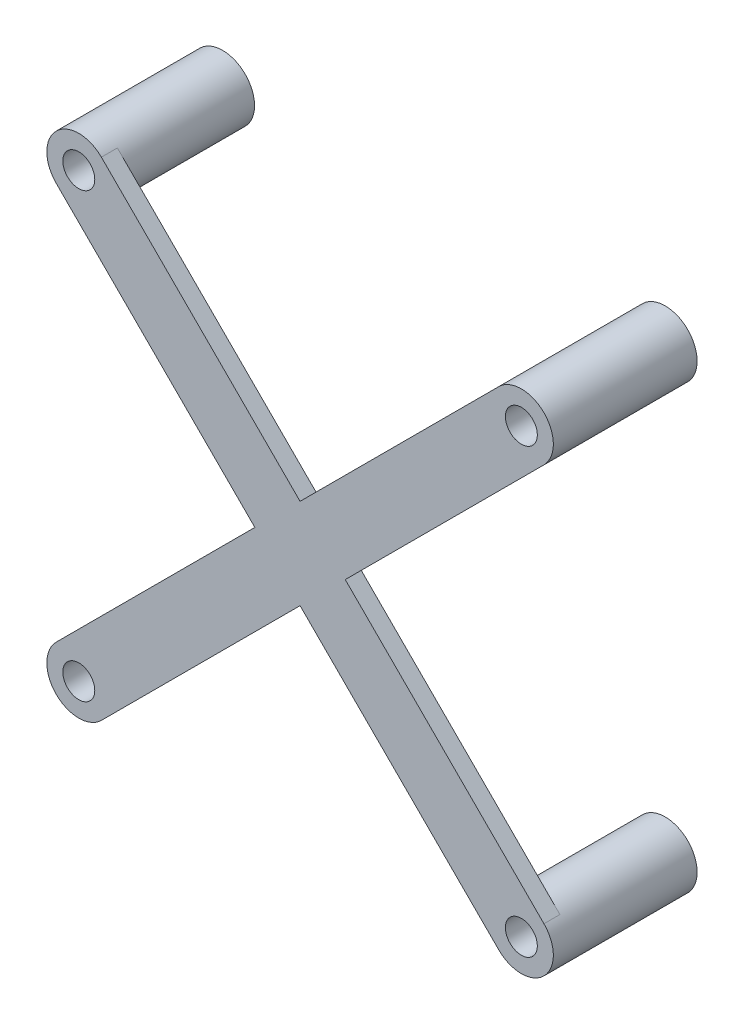
ISO-10303-21;
HEADER;
FILE_DESCRIPTION(('STEP AP214'),'2;1');
FILE_NAME('part.step','',(''),(''),'','','');
FILE_SCHEMA(('AUTOMOTIVE_DESIGN { 1 0 10303 214 1 1 1 1 }'));
ENDSEC;
DATA;
#1=APPLICATION_CONTEXT('core data for automotive mechanical design processes');
#2=APPLICATION_PROTOCOL_DEFINITION('international standard','automotive_design',2000,#1);
#3=PRODUCT_CONTEXT('',#1,'mechanical');
#4=PRODUCT('Part','Part','',(#3));
#5=PRODUCT_RELATED_PRODUCT_CATEGORY('part','',(#4));
#6=PRODUCT_DEFINITION_FORMATION('','',#4);
#7=PRODUCT_DEFINITION_CONTEXT('part definition',#1,'design');
#8=PRODUCT_DEFINITION('design','',#6,#7);
#9=PRODUCT_DEFINITION_SHAPE('','',#8);
#10=(LENGTH_UNIT() NAMED_UNIT(*) SI_UNIT(.MILLI.,.METRE.));
#11=(NAMED_UNIT(*) PLANE_ANGLE_UNIT() SI_UNIT($,.RADIAN.));
#12=(NAMED_UNIT(*) SI_UNIT($,.STERADIAN.) SOLID_ANGLE_UNIT());
#13=UNCERTAINTY_MEASURE_WITH_UNIT(LENGTH_MEASURE(1.E-05),#10,'distance_accuracy_value','');
#14=(GEOMETRIC_REPRESENTATION_CONTEXT(3) GLOBAL_UNCERTAINTY_ASSIGNED_CONTEXT((#13)) GLOBAL_UNIT_ASSIGNED_CONTEXT((#10,
#11,#12)) REPRESENTATION_CONTEXT('',''));
#15=CARTESIAN_POINT('',(0.,0.,0.));
#16=DIRECTION('',(0.,0.,1.));
#17=DIRECTION('',(1.,0.,0.));
#18=AXIS2_PLACEMENT_3D('',#15,#16,#17);
#19=CARTESIAN_POINT('',(-13.85,-13.85,8.));
#20=DIRECTION('',(0.,0.,1.));
#21=DIRECTION('',(1.,0.,0.));
#22=AXIS2_PLACEMENT_3D('',#19,#20,#21);
#23=PLANE('',#22);
#24=CARTESIAN_POINT('',(13.8499999999999,-13.8500000000001,8.));
#25=DIRECTION('',(0.,0.,1.));
#26=DIRECTION('',(1.,0.,0.));
#27=AXIS2_PLACEMENT_3D('',#24,#25,#26);
#28=CIRCLE('',#27,2.);
#29=CARTESIAN_POINT('',(15.264213562373,-12.4357864376271,8.));
#30=VERTEX_POINT('',#29);
#31=CARTESIAN_POINT('',(12.4357864376268,-15.2642135623732,8.));
#32=VERTEX_POINT('',#31);
#33=EDGE_CURVE('E226',#30,#32,#28,.T.);
#34=ORIENTED_EDGE('',*,*,#33,.T.);
#35=DIRECTION('',(0.707106781186548,-0.707106781186547,0.));
#36=VECTOR('',#35,1.);
#37=CARTESIAN_POINT('',(-1.47451495458029E-13,-2.82842712474634,8.));
#38=LINE('',#37,#36);
#39=CARTESIAN_POINT('',(-1.47451495458029E-13,-2.82842712474634,8.));
#40=VERTEX_POINT('',#39);
#41=EDGE_CURVE('E167',#40,#32,#38,.T.);
#42=ORIENTED_EDGE('',*,*,#41,.F.);
#43=DIRECTION('',(0.707106781186548,0.707106781186548,0.));
#44=VECTOR('',#43,1.);
#45=CARTESIAN_POINT('',(-12.4357864376269,-15.2642135623731,8.));
#46=LINE('',#45,#44);
#47=CARTESIAN_POINT('',(-12.4357864376269,-15.2642135623731,8.));
#48=VERTEX_POINT('',#47);
#49=EDGE_CURVE('E165',#48,#40,#46,.T.);
#50=ORIENTED_EDGE('',*,*,#49,.F.);
#51=CARTESIAN_POINT('',(-13.85,-13.85,8.));
#52=DIRECTION('',(0.,0.,1.));
#53=DIRECTION('',(1.,0.,0.));
#54=AXIS2_PLACEMENT_3D('',#51,#52,#53);
#55=CIRCLE('',#54,2.);
#56=CARTESIAN_POINT('',(-15.2642135623731,-12.4357864376269,8.));
#57=VERTEX_POINT('',#56);
#58=EDGE_CURVE('E11',#48,#57,#55,.T.);
#59=ORIENTED_EDGE('',*,*,#58,.T.);
#60=DIRECTION('',(-0.707106781186547,-0.707106781186548,0.));
#61=VECTOR('',#60,1.);
#62=CARTESIAN_POINT('',(-15.2642135623731,-12.4357864376269,8.));
#63=LINE('',#62,#61);
#64=CARTESIAN_POINT('',(-2.82842712474634,-1.43114686768087E-13,8.));
#65=VERTEX_POINT('',#64);
#66=EDGE_CURVE('E183',#65,#57,#63,.T.);
#67=ORIENTED_EDGE('',*,*,#66,.F.);
#68=DIRECTION('',(0.707106781186548,-0.707106781186547,0.));
#69=VECTOR('',#68,1.);
#70=CARTESIAN_POINT('',(-15.2642135623732,12.4357864376268,8.));
#71=LINE('',#70,#69);
#72=CARTESIAN_POINT('',(-15.2642135623732,12.4357864376268,8.));
#73=VERTEX_POINT('',#72);
#74=EDGE_CURVE('E181',#73,#65,#71,.T.);
#75=ORIENTED_EDGE('',*,*,#74,.F.);
#76=CARTESIAN_POINT('',(-13.85,13.8500000000001,8.));
#77=DIRECTION('',(0.,0.,1.));
#78=DIRECTION('',(1.,0.,0.));
#79=AXIS2_PLACEMENT_3D('',#76,#77,#78);
#80=CIRCLE('',#79,2.);
#81=CARTESIAN_POINT('',(-12.4357864376269,15.2642135623731,8.));
#82=VERTEX_POINT('',#81);
#83=EDGE_CURVE('E152',#73,#82,#80,.T.);
#84=ORIENTED_EDGE('',*,*,#83,.T.);
#85=DIRECTION('',(-0.70710678118654,0.707106781186555,0.));
#86=VECTOR('',#85,1.);
#87=CARTESIAN_POINT('',(-12.4357864376268,15.2642135623732,8.));
#88=LINE('',#87,#86);
#89=CARTESIAN_POINT('',(0.,2.8284271247462,8.));
#90=VERTEX_POINT('',#89);
#91=EDGE_CURVE('E178',#90,#82,#88,.T.);
#92=ORIENTED_EDGE('',*,*,#91,.F.);
#93=DIRECTION('',(-0.707106781186548,-0.707106781186548,0.));
#94=VECTOR('',#93,1.);
#95=CARTESIAN_POINT('',(0.,2.8284271247462,8.));
#96=LINE('',#95,#94);
#97=CARTESIAN_POINT('',(12.4357864376269,15.2642135623731,8.));
#98=VERTEX_POINT('',#97);
#99=EDGE_CURVE('E176',#98,#90,#96,.T.);
#100=ORIENTED_EDGE('',*,*,#99,.F.);
#101=CARTESIAN_POINT('',(13.8500000000001,13.8499999999999,8.));
#102=DIRECTION('',(0.,0.,1.));
#103=DIRECTION('',(1.,0.,0.));
#104=AXIS2_PLACEMENT_3D('',#101,#102,#103);
#105=CIRCLE('',#104,2.);
#106=CARTESIAN_POINT('',(15.2642135623732,12.4357864376268,8.));
#107=VERTEX_POINT('',#106);
#108=EDGE_CURVE('E237',#98,#107,#105,.T.);
#109=ORIENTED_EDGE('',*,*,#108,.T.);
#110=DIRECTION('',(0.707106781186548,0.707106781186547,0.));
#111=VECTOR('',#110,1.);
#112=CARTESIAN_POINT('',(2.82842712474617,0.,8.));
#113=LINE('',#112,#111);
#114=CARTESIAN_POINT('',(2.82842712474617,0.,8.));
#115=VERTEX_POINT('',#114);
#116=EDGE_CURVE('E173',#115,#107,#113,.T.);
#117=ORIENTED_EDGE('',*,*,#116,.F.);
#118=DIRECTION('',(-0.70710678118654,0.707106781186555,0.));
#119=VECTOR('',#118,1.);
#120=CARTESIAN_POINT('',(2.82842712474617,0.,8.));
#121=LINE('',#120,#119);
#122=EDGE_CURVE('E171',#30,#115,#121,.T.);
#123=ORIENTED_EDGE('',*,*,#122,.F.);
#124=EDGE_LOOP('',(#34,#42,#50,#59,#67,#75,#84,#92,#100,#109,#117,#123));
#125=FACE_BOUND('',#124,.T.);
#126=ADVANCED_FACE('F45',(#125),#23,.F.);
#127=CARTESIAN_POINT('',(-13.85,-13.85,8.));
#128=DIRECTION('',(0.,0.,-1.));
#129=DIRECTION('',(-1.,0.,0.));
#130=AXIS2_PLACEMENT_3D('',#127,#128,#129);
#131=CYLINDRICAL_SURFACE('',#130,2.);
#132=ORIENTED_EDGE('',*,*,#58,.F.);
#133=DIRECTION('',(0.,0.,-1.));
#134=VECTOR('',#133,1.);
#135=CARTESIAN_POINT('',(-12.4357864376269,-15.2642135623731,9.));
#136=LINE('',#135,#134);
#137=CARTESIAN_POINT('',(-12.4357864376269,-15.2642135623731,9.));
#138=VERTEX_POINT('',#137);
#139=EDGE_CURVE('E210',#138,#48,#136,.T.);
#140=ORIENTED_EDGE('',*,*,#139,.F.);
#141=CARTESIAN_POINT('',(-13.85,-13.85,9.));
#142=DIRECTION('',(0.,0.,1.));
#143=DIRECTION('',(1.,0.,0.));
#144=AXIS2_PLACEMENT_3D('',#141,#142,#143);
#145=CIRCLE('',#144,2.);
#146=CARTESIAN_POINT('',(-15.2642135623731,-12.4357864376269,9.));
#147=VERTEX_POINT('',#146);
#148=EDGE_CURVE('E185',#147,#138,#145,.T.);
#149=ORIENTED_EDGE('',*,*,#148,.F.);
#150=DIRECTION('',(0.,0.,-1.));
#151=VECTOR('',#150,1.);
#152=CARTESIAN_POINT('',(-15.2642135623731,-12.4357864376269,9.));
#153=LINE('',#152,#151);
#154=EDGE_CURVE('E161',#147,#57,#153,.T.);
#155=ORIENTED_EDGE('',*,*,#154,.T.);
#156=EDGE_LOOP('',(#132,#140,#149,#155));
#157=FACE_BOUND('',#156,.T.);
#158=CARTESIAN_POINT('',(-13.85,-13.85,0.));
#159=DIRECTION('',(0.,0.,1.));
#160=DIRECTION('',(1.,0.,0.));
#161=AXIS2_PLACEMENT_3D('',#158,#159,#160);
#162=CIRCLE('',#161,2.);
#163=CARTESIAN_POINT('',(-11.85,-13.85,0.));
#164=VERTEX_POINT('',#163);
#165=EDGE_CURVE('E54',#164,#164,#162,.T.);
#166=ORIENTED_EDGE('',*,*,#165,.T.);
#167=EDGE_LOOP('',(#166));
#168=FACE_BOUND('',#167,.T.);
#169=ADVANCED_FACE('F47',(#157,#168),#131,.T.);
#170=CARTESIAN_POINT('',(-13.85,-13.85,0.));
#171=DIRECTION('',(0.,0.,1.));
#172=DIRECTION('',(1.,0.,0.));
#173=AXIS2_PLACEMENT_3D('',#170,#171,#172);
#174=PLANE('',#173);
#175=CARTESIAN_POINT('',(-13.85,-13.85,0.));
#176=DIRECTION('',(0.,0.,1.));
#177=DIRECTION('',(1.,0.,0.));
#178=AXIS2_PLACEMENT_3D('',#175,#176,#177);
#179=CIRCLE('',#178,1.);
#180=CARTESIAN_POINT('',(-12.85,-13.85,0.));
#181=VERTEX_POINT('',#180);
#182=EDGE_CURVE('E222',#181,#181,#179,.F.);
#183=ORIENTED_EDGE('',*,*,#182,.F.);
#184=EDGE_LOOP('',(#183));
#185=FACE_BOUND('',#184,.T.);
#186=ORIENTED_EDGE('',*,*,#165,.F.);
#187=EDGE_LOOP('',(#186));
#188=FACE_BOUND('',#187,.T.);
#189=ADVANCED_FACE('F308',(#185,#188),#174,.F.);
#190=CARTESIAN_POINT('',(-12.4357864376269,-15.2642135623731,9.));
#191=DIRECTION('',(-0.707106781186547,0.707106781186547,0.));
#192=DIRECTION('',(-0.707106781186548,-0.707106781186548,0.));
#193=AXIS2_PLACEMENT_3D('',#190,#191,#192);
#194=PLANE('',#193);
#195=ORIENTED_EDGE('',*,*,#49,.T.);
#196=DIRECTION('',(0.,0.,-1.));
#197=VECTOR('',#196,1.);
#198=CARTESIAN_POINT('',(-1.47451495458029E-13,-2.82842712474634,9.));
#199=LINE('',#198,#197);
#200=CARTESIAN_POINT('',(-1.47451495458029E-13,-2.82842712474634,9.));
#201=VERTEX_POINT('',#200);
#202=EDGE_CURVE('E207',#201,#40,#199,.T.);
#203=ORIENTED_EDGE('',*,*,#202,.F.);
#204=DIRECTION('',(0.707106781186548,0.707106781186548,0.));
#205=VECTOR('',#204,1.);
#206=CARTESIAN_POINT('',(-12.4357864376269,-15.2642135623731,9.));
#207=LINE('',#206,#205);
#208=EDGE_CURVE('E108',#138,#201,#207,.T.);
#209=ORIENTED_EDGE('',*,*,#208,.F.);
#210=ORIENTED_EDGE('',*,*,#139,.T.);
#211=EDGE_LOOP('',(#195,#203,#209,#210));
#212=FACE_BOUND('',#211,.T.);
#213=ADVANCED_FACE('F288',(#212),#194,.F.);
#214=CARTESIAN_POINT('',(-1.47451495458029E-13,-2.82842712474634,9.));
#215=DIRECTION('',(0.707106781186547,0.707106781186548,0.));
#216=DIRECTION('',(-0.707106781186548,0.707106781186547,0.));
#217=AXIS2_PLACEMENT_3D('',#214,#215,#216);
#218=PLANE('',#217);
#219=ORIENTED_EDGE('',*,*,#41,.T.);
#220=DIRECTION('',(0.,0.,-1.));
#221=VECTOR('',#220,1.);
#222=CARTESIAN_POINT('',(12.4357864376269,-15.2642135623731,9.));
#223=LINE('',#222,#221);
#224=CARTESIAN_POINT('',(12.4357864376269,-15.2642135623731,9.));
#225=VERTEX_POINT('',#224);
#226=EDGE_CURVE('E204',#225,#32,#223,.T.);
#227=ORIENTED_EDGE('',*,*,#226,.F.);
#228=DIRECTION('',(0.707106781186548,-0.707106781186547,0.));
#229=VECTOR('',#228,1.);
#230=CARTESIAN_POINT('',(-1.47451495458029E-13,-2.82842712474634,9.));
#231=LINE('',#230,#229);
#232=EDGE_CURVE('E249',#201,#225,#231,.T.);
#233=ORIENTED_EDGE('',*,*,#232,.F.);
#234=ORIENTED_EDGE('',*,*,#202,.T.);
#235=EDGE_LOOP('',(#219,#227,#233,#234));
#236=FACE_BOUND('',#235,.T.);
#237=ADVANCED_FACE('F280',(#236),#218,.F.);
#238=CARTESIAN_POINT('',(13.85,-13.85,9.));
#239=DIRECTION('',(0.,0.,-1.));
#240=DIRECTION('',(-1.,0.,0.));
#241=AXIS2_PLACEMENT_3D('',#238,#239,#240);
#242=CYLINDRICAL_SURFACE('',#241,2.);
#243=ORIENTED_EDGE('',*,*,#226,.T.);
#244=ORIENTED_EDGE('',*,*,#33,.F.);
#245=DIRECTION('',(0.,0.,-1.));
#246=VECTOR('',#245,1.);
#247=CARTESIAN_POINT('',(15.264213562373,-12.4357864376271,9.));
#248=LINE('',#247,#246);
#249=CARTESIAN_POINT('',(15.264213562373,-12.4357864376271,9.));
#250=VERTEX_POINT('',#249);
#251=EDGE_CURVE('E201',#250,#30,#248,.T.);
#252=ORIENTED_EDGE('',*,*,#251,.F.);
#253=CARTESIAN_POINT('',(13.85,-13.85,9.));
#254=DIRECTION('',(0.,0.,1.));
#255=DIRECTION('',(1.,0.,0.));
#256=AXIS2_PLACEMENT_3D('',#253,#254,#255);
#257=CIRCLE('',#256,2.);
#258=EDGE_CURVE('E251',#225,#250,#257,.T.);
#259=ORIENTED_EDGE('',*,*,#258,.F.);
#260=EDGE_LOOP('',(#243,#244,#252,#259));
#261=FACE_BOUND('',#260,.T.);
#262=CARTESIAN_POINT('',(13.8499999999999,-13.8500000000001,0.));
#263=DIRECTION('',(0.,0.,1.));
#264=DIRECTION('',(1.,0.,0.));
#265=AXIS2_PLACEMENT_3D('',#262,#263,#264);
#266=CIRCLE('',#265,2.);
#267=CARTESIAN_POINT('',(15.8499999999999,-13.8500000000001,0.));
#268=VERTEX_POINT('',#267);
#269=EDGE_CURVE('E231',#268,#268,#266,.T.);
#270=ORIENTED_EDGE('',*,*,#269,.T.);
#271=EDGE_LOOP('',(#270));
#272=FACE_BOUND('',#271,.T.);
#273=ADVANCED_FACE('F283',(#261,#272),#242,.T.);
#274=CARTESIAN_POINT('',(2.82842712474617,0.,9.));
#275=DIRECTION('',(-0.707106781186555,-0.70710678118654,0.));
#276=DIRECTION('',(0.70710678118654,-0.707106781186555,0.));
#277=AXIS2_PLACEMENT_3D('',#274,#275,#276);
#278=PLANE('',#277);
#279=ORIENTED_EDGE('',*,*,#122,.T.);
#280=DIRECTION('',(0.,0.,-1.));
#281=VECTOR('',#280,1.);
#282=CARTESIAN_POINT('',(2.82842712474617,0.,9.));
#283=LINE('',#282,#281);
#284=CARTESIAN_POINT('',(2.82842712474617,0.,9.));
#285=VERTEX_POINT('',#284);
#286=EDGE_CURVE('E198',#285,#115,#283,.T.);
#287=ORIENTED_EDGE('',*,*,#286,.F.);
#288=DIRECTION('',(-0.70710678118654,0.707106781186555,0.));
#289=VECTOR('',#288,1.);
#290=CARTESIAN_POINT('',(2.82842712474617,0.,9.));
#291=LINE('',#290,#289);
#292=EDGE_CURVE('E253',#250,#285,#291,.T.);
#293=ORIENTED_EDGE('',*,*,#292,.F.);
#294=ORIENTED_EDGE('',*,*,#251,.T.);
#295=EDGE_LOOP('',(#279,#287,#293,#294));
#296=FACE_BOUND('',#295,.T.);
#297=ADVANCED_FACE('F359',(#296),#278,.F.);
#298=CARTESIAN_POINT('',(2.82842712474617,0.,9.));
#299=DIRECTION('',(-0.707106781186547,0.707106781186548,0.));
#300=DIRECTION('',(-0.707106781186548,-0.707106781186547,0.));
#301=AXIS2_PLACEMENT_3D('',#298,#299,#300);
#302=PLANE('',#301);
#303=ORIENTED_EDGE('',*,*,#116,.T.);
#304=DIRECTION('',(0.,0.,-1.));
#305=VECTOR('',#304,1.);
#306=CARTESIAN_POINT('',(15.2642135623731,12.4357864376269,9.));
#307=LINE('',#306,#305);
#308=CARTESIAN_POINT('',(15.2642135623731,12.4357864376269,9.));
#309=VERTEX_POINT('',#308);
#310=EDGE_CURVE('E195',#309,#107,#307,.T.);
#311=ORIENTED_EDGE('',*,*,#310,.F.);
#312=DIRECTION('',(0.707106781186548,0.707106781186547,0.));
#313=VECTOR('',#312,1.);
#314=CARTESIAN_POINT('',(2.82842712474617,0.,9.));
#315=LINE('',#314,#313);
#316=EDGE_CURVE('E255',#285,#309,#315,.T.);
#317=ORIENTED_EDGE('',*,*,#316,.F.);
#318=ORIENTED_EDGE('',*,*,#286,.T.);
#319=EDGE_LOOP('',(#303,#311,#317,#318));
#320=FACE_BOUND('',#319,.T.);
#321=ADVANCED_FACE('F365',(#320),#302,.F.);
#322=CARTESIAN_POINT('',(13.85,13.85,9.));
#323=DIRECTION('',(0.,0.,-1.));
#324=DIRECTION('',(-1.,0.,0.));
#325=AXIS2_PLACEMENT_3D('',#322,#323,#324);
#326=CYLINDRICAL_SURFACE('',#325,2.);
#327=ORIENTED_EDGE('',*,*,#310,.T.);
#328=ORIENTED_EDGE('',*,*,#108,.F.);
#329=DIRECTION('',(0.,0.,-1.));
#330=VECTOR('',#329,1.);
#331=CARTESIAN_POINT('',(12.4357864376269,15.2642135623731,9.));
#332=LINE('',#331,#330);
#333=CARTESIAN_POINT('',(12.4357864376269,15.2642135623731,9.));
#334=VERTEX_POINT('',#333);
#335=EDGE_CURVE('E192',#334,#98,#332,.T.);
#336=ORIENTED_EDGE('',*,*,#335,.F.);
#337=CARTESIAN_POINT('',(13.85,13.85,9.));
#338=DIRECTION('',(0.,0.,1.));
#339=DIRECTION('',(1.,0.,0.));
#340=AXIS2_PLACEMENT_3D('',#337,#338,#339);
#341=CIRCLE('',#340,2.);
#342=EDGE_CURVE('E257',#309,#334,#341,.T.);
#343=ORIENTED_EDGE('',*,*,#342,.F.);
#344=EDGE_LOOP('',(#327,#328,#336,#343));
#345=FACE_BOUND('',#344,.T.);
#346=CARTESIAN_POINT('',(13.8500000000001,13.8499999999999,0.));
#347=DIRECTION('',(0.,0.,1.));
#348=DIRECTION('',(1.,0.,0.));
#349=AXIS2_PLACEMENT_3D('',#346,#347,#348);
#350=CIRCLE('',#349,2.);
#351=CARTESIAN_POINT('',(15.8500000000001,13.8499999999999,0.));
#352=VERTEX_POINT('',#351);
#353=EDGE_CURVE('E239',#352,#352,#350,.T.);
#354=ORIENTED_EDGE('',*,*,#353,.T.);
#355=EDGE_LOOP('',(#354));
#356=FACE_BOUND('',#355,.T.);
#357=ADVANCED_FACE('F446',(#345,#356),#326,.T.);
#358=CARTESIAN_POINT('',(0.,2.8284271247462,9.));
#359=DIRECTION('',(0.707106781186548,-0.707106781186547,0.));
#360=DIRECTION('',(0.707106781186547,0.707106781186548,0.));
#361=AXIS2_PLACEMENT_3D('',#358,#359,#360);
#362=PLANE('',#361);
#363=ORIENTED_EDGE('',*,*,#99,.T.);
#364=DIRECTION('',(0.,0.,-1.));
#365=VECTOR('',#364,1.);
#366=CARTESIAN_POINT('',(0.,2.8284271247462,9.));
#367=LINE('',#366,#365);
#368=CARTESIAN_POINT('',(0.,2.8284271247462,9.));
#369=VERTEX_POINT('',#368);
#370=EDGE_CURVE('E189',#369,#90,#367,.T.);
#371=ORIENTED_EDGE('',*,*,#370,.F.);
#372=DIRECTION('',(-0.707106781186548,-0.707106781186548,0.));
#373=VECTOR('',#372,1.);
#374=CARTESIAN_POINT('',(0.,2.8284271247462,9.));
#375=LINE('',#374,#373);
#376=EDGE_CURVE('E259',#334,#369,#375,.T.);
#377=ORIENTED_EDGE('',*,*,#376,.F.);
#378=ORIENTED_EDGE('',*,*,#335,.T.);
#379=EDGE_LOOP('',(#363,#371,#377,#378));
#380=FACE_BOUND('',#379,.T.);
#381=ADVANCED_FACE('F265',(#380),#362,.F.);
#382=CARTESIAN_POINT('',(-12.4357864376268,15.2642135623732,9.));
#383=DIRECTION('',(-0.707106781186555,-0.70710678118654,0.));
#384=DIRECTION('',(0.70710678118654,-0.707106781186555,0.));
#385=AXIS2_PLACEMENT_3D('',#382,#383,#384);
#386=PLANE('',#385);
#387=ORIENTED_EDGE('',*,*,#91,.T.);
#388=DIRECTION('',(0.,0.,-1.));
#389=VECTOR('',#388,1.);
#390=CARTESIAN_POINT('',(-12.4357864376268,15.2642135623732,9.));
#391=LINE('',#390,#389);
#392=CARTESIAN_POINT('',(-12.4357864376268,15.2642135623732,9.));
#393=VERTEX_POINT('',#392);
#394=EDGE_CURVE('E155',#393,#82,#391,.T.);
#395=ORIENTED_EDGE('',*,*,#394,.F.);
#396=DIRECTION('',(-0.70710678118654,0.707106781186555,0.));
#397=VECTOR('',#396,1.);
#398=CARTESIAN_POINT('',(-12.4357864376268,15.2642135623732,9.));
#399=LINE('',#398,#397);
#400=EDGE_CURVE('E142',#369,#393,#399,.T.);
#401=ORIENTED_EDGE('',*,*,#400,.F.);
#402=ORIENTED_EDGE('',*,*,#370,.T.);
#403=EDGE_LOOP('',(#387,#395,#401,#402));
#404=FACE_BOUND('',#403,.T.);
#405=ADVANCED_FACE('F269',(#404),#386,.F.);
#406=CARTESIAN_POINT('',(-13.85,13.85,9.));
#407=DIRECTION('',(0.,0.,-1.));
#408=DIRECTION('',(-1.,0.,0.));
#409=AXIS2_PLACEMENT_3D('',#406,#407,#408);
#410=CYLINDRICAL_SURFACE('',#409,2.0000000000002);
#411=ORIENTED_EDGE('',*,*,#394,.T.);
#412=ORIENTED_EDGE('',*,*,#83,.F.);
#413=DIRECTION('',(0.,0.,-1.));
#414=VECTOR('',#413,1.);
#415=CARTESIAN_POINT('',(-15.2642135623732,12.4357864376268,9.));
#416=LINE('',#415,#414);
#417=CARTESIAN_POINT('',(-15.2642135623732,12.4357864376268,9.));
#418=VERTEX_POINT('',#417);
#419=EDGE_CURVE('E148',#418,#73,#416,.T.);
#420=ORIENTED_EDGE('',*,*,#419,.F.);
#421=CARTESIAN_POINT('',(-13.85,13.85,9.));
#422=DIRECTION('',(0.,0.,1.));
#423=DIRECTION('',(1.,0.,0.));
#424=AXIS2_PLACEMENT_3D('',#421,#422,#423);
#425=CIRCLE('',#424,2.0000000000002);
#426=EDGE_CURVE('E135',#393,#418,#425,.T.);
#427=ORIENTED_EDGE('',*,*,#426,.F.);
#428=EDGE_LOOP('',(#411,#412,#420,#427));
#429=FACE_BOUND('',#428,.T.);
#430=CARTESIAN_POINT('',(-13.85,13.8500000000001,0.));
#431=DIRECTION('',(0.,0.,1.));
#432=DIRECTION('',(1.,0.,0.));
#433=AXIS2_PLACEMENT_3D('',#430,#431,#432);
#434=CIRCLE('',#433,2.);
#435=CARTESIAN_POINT('',(-11.85,13.8500000000001,0.));
#436=VERTEX_POINT('',#435);
#437=EDGE_CURVE('E168',#436,#436,#434,.T.);
#438=ORIENTED_EDGE('',*,*,#437,.T.);
#439=EDGE_LOOP('',(#438));
#440=FACE_BOUND('',#439,.T.);
#441=ADVANCED_FACE('F149',(#429,#440),#410,.T.);
#442=CARTESIAN_POINT('',(-15.2642135623732,12.4357864376268,9.));
#443=DIRECTION('',(0.707106781186547,0.707106781186548,0.));
#444=DIRECTION('',(-0.707106781186548,0.707106781186547,0.));
#445=AXIS2_PLACEMENT_3D('',#442,#443,#444);
#446=PLANE('',#445);
#447=ORIENTED_EDGE('',*,*,#74,.T.);
#448=DIRECTION('',(0.,0.,-1.));
#449=VECTOR('',#448,1.);
#450=CARTESIAN_POINT('',(-2.82842712474634,-1.43114686768087E-13,9.));
#451=LINE('',#450,#449);
#452=CARTESIAN_POINT('',(-2.82842712474634,-1.43114686768087E-13,9.));
#453=VERTEX_POINT('',#452);
#454=EDGE_CURVE('E156',#453,#65,#451,.T.);
#455=ORIENTED_EDGE('',*,*,#454,.F.);
#456=DIRECTION('',(0.707106781186548,-0.707106781186547,0.));
#457=VECTOR('',#456,1.);
#458=CARTESIAN_POINT('',(-15.2642135623732,12.4357864376268,9.));
#459=LINE('',#458,#457);
#460=EDGE_CURVE('E139',#418,#453,#459,.T.);
#461=ORIENTED_EDGE('',*,*,#460,.F.);
#462=ORIENTED_EDGE('',*,*,#419,.T.);
#463=EDGE_LOOP('',(#447,#455,#461,#462));
#464=FACE_BOUND('',#463,.T.);
#465=ADVANCED_FACE('F158',(#464),#446,.F.);
#466=CARTESIAN_POINT('',(-15.2642135623731,-12.4357864376269,9.));
#467=DIRECTION('',(0.707106781186548,-0.707106781186547,0.));
#468=DIRECTION('',(0.707106781186547,0.707106781186548,0.));
#469=AXIS2_PLACEMENT_3D('',#466,#467,#468);
#470=PLANE('',#469);
#471=ORIENTED_EDGE('',*,*,#66,.T.);
#472=ORIENTED_EDGE('',*,*,#154,.F.);
#473=DIRECTION('',(-0.707106781186547,-0.707106781186548,0.));
#474=VECTOR('',#473,1.);
#475=CARTESIAN_POINT('',(-15.2642135623731,-12.4357864376269,9.));
#476=LINE('',#475,#474);
#477=EDGE_CURVE('E69',#453,#147,#476,.T.);
#478=ORIENTED_EDGE('',*,*,#477,.F.);
#479=ORIENTED_EDGE('',*,*,#454,.T.);
#480=EDGE_LOOP('',(#471,#472,#478,#479));
#481=FACE_BOUND('',#480,.T.);
#482=ADVANCED_FACE('F291',(#481),#470,.F.);
#483=CARTESIAN_POINT('',(-13.85,-13.85,9.));
#484=DIRECTION('',(0.,0.,1.));
#485=DIRECTION('',(1.,0.,0.));
#486=AXIS2_PLACEMENT_3D('',#483,#484,#485);
#487=PLANE('',#486);
#488=CARTESIAN_POINT('',(13.8499999999999,-13.8500000000001,9.));
#489=DIRECTION('',(0.,0.,1.));
#490=DIRECTION('',(1.,0.,0.));
#491=AXIS2_PLACEMENT_3D('',#488,#489,#490);
#492=CIRCLE('',#491,1.);
#493=CARTESIAN_POINT('',(14.8499999999999,-13.8500000000001,9.));
#494=VERTEX_POINT('',#493);
#495=EDGE_CURVE('E346',#494,#494,#492,.T.);
#496=ORIENTED_EDGE('',*,*,#495,.F.);
#497=EDGE_LOOP('',(#496));
#498=FACE_BOUND('',#497,.T.);
#499=CARTESIAN_POINT('',(13.8500000000001,13.8499999999999,9.));
#500=DIRECTION('',(0.,0.,1.));
#501=DIRECTION('',(1.,0.,0.));
#502=AXIS2_PLACEMENT_3D('',#499,#500,#501);
#503=CIRCLE('',#502,1.);
#504=CARTESIAN_POINT('',(14.8500000000001,13.8499999999999,9.));
#505=VERTEX_POINT('',#504);
#506=EDGE_CURVE('E342',#505,#505,#503,.T.);
#507=ORIENTED_EDGE('',*,*,#506,.F.);
#508=EDGE_LOOP('',(#507));
#509=FACE_BOUND('',#508,.T.);
#510=CARTESIAN_POINT('',(-13.85,13.8500000000001,9.));
#511=DIRECTION('',(0.,0.,1.));
#512=DIRECTION('',(1.,0.,0.));
#513=AXIS2_PLACEMENT_3D('',#510,#511,#512);
#514=CIRCLE('',#513,1.);
#515=CARTESIAN_POINT('',(-12.85,13.8500000000001,9.));
#516=VERTEX_POINT('',#515);
#517=EDGE_CURVE('E340',#516,#516,#514,.T.);
#518=ORIENTED_EDGE('',*,*,#517,.F.);
#519=EDGE_LOOP('',(#518));
#520=FACE_BOUND('',#519,.T.);
#521=CARTESIAN_POINT('',(-13.85,-13.85,9.));
#522=DIRECTION('',(0.,0.,1.));
#523=DIRECTION('',(1.,0.,0.));
#524=AXIS2_PLACEMENT_3D('',#521,#522,#523);
#525=CIRCLE('',#524,1.);
#526=CARTESIAN_POINT('',(-12.85,-13.85,9.));
#527=VERTEX_POINT('',#526);
#528=EDGE_CURVE('E217',#527,#527,#525,.T.);
#529=ORIENTED_EDGE('',*,*,#528,.F.);
#530=EDGE_LOOP('',(#529));
#531=FACE_BOUND('',#530,.T.);
#532=ORIENTED_EDGE('',*,*,#148,.T.);
#533=ORIENTED_EDGE('',*,*,#208,.T.);
#534=ORIENTED_EDGE('',*,*,#232,.T.);
#535=ORIENTED_EDGE('',*,*,#258,.T.);
#536=ORIENTED_EDGE('',*,*,#292,.T.);
#537=ORIENTED_EDGE('',*,*,#316,.T.);
#538=ORIENTED_EDGE('',*,*,#342,.T.);
#539=ORIENTED_EDGE('',*,*,#376,.T.);
#540=ORIENTED_EDGE('',*,*,#400,.T.);
#541=ORIENTED_EDGE('',*,*,#426,.T.);
#542=ORIENTED_EDGE('',*,*,#460,.T.);
#543=ORIENTED_EDGE('',*,*,#477,.T.);
#544=EDGE_LOOP('',(#532,#533,#534,#535,#536,#537,#538,#539,#540,#541,#542,#543));
#545=FACE_BOUND('',#544,.T.);
#546=ADVANCED_FACE('F137',(#498,#509,#520,#531,#545),#487,.T.);
#547=CARTESIAN_POINT('',(-13.85,13.8500000000001,0.));
#548=DIRECTION('',(0.,0.,1.));
#549=DIRECTION('',(1.,0.,0.));
#550=AXIS2_PLACEMENT_3D('',#547,#548,#549);
#551=PLANE('',#550);
#552=CARTESIAN_POINT('',(-13.85,13.8500000000001,0.));
#553=DIRECTION('',(0.,0.,1.));
#554=DIRECTION('',(1.,0.,0.));
#555=AXIS2_PLACEMENT_3D('',#552,#553,#554);
#556=CIRCLE('',#555,1.);
#557=CARTESIAN_POINT('',(-12.85,13.8500000000001,0.));
#558=VERTEX_POINT('',#557);
#559=EDGE_CURVE('E49',#558,#558,#556,.F.);
#560=ORIENTED_EDGE('',*,*,#559,.F.);
#561=EDGE_LOOP('',(#560));
#562=FACE_BOUND('',#561,.T.);
#563=ORIENTED_EDGE('',*,*,#437,.F.);
#564=EDGE_LOOP('',(#563));
#565=FACE_BOUND('',#564,.T.);
#566=ADVANCED_FACE('F299',(#562,#565),#551,.F.);
#567=CARTESIAN_POINT('',(13.8500000000001,13.8499999999999,0.));
#568=DIRECTION('',(0.,0.,1.));
#569=DIRECTION('',(1.,0.,0.));
#570=AXIS2_PLACEMENT_3D('',#567,#568,#569);
#571=PLANE('',#570);
#572=CARTESIAN_POINT('',(13.8500000000001,13.8499999999999,0.));
#573=DIRECTION('',(0.,0.,1.));
#574=DIRECTION('',(1.,0.,0.));
#575=AXIS2_PLACEMENT_3D('',#572,#573,#574);
#576=CIRCLE('',#575,1.);
#577=CARTESIAN_POINT('',(14.8500000000001,13.8499999999999,0.));
#578=VERTEX_POINT('',#577);
#579=EDGE_CURVE('E216',#578,#578,#576,.F.);
#580=ORIENTED_EDGE('',*,*,#579,.F.);
#581=EDGE_LOOP('',(#580));
#582=FACE_BOUND('',#581,.T.);
#583=ORIENTED_EDGE('',*,*,#353,.F.);
#584=EDGE_LOOP('',(#583));
#585=FACE_BOUND('',#584,.T.);
#586=ADVANCED_FACE('F312',(#582,#585),#571,.F.);
#587=CARTESIAN_POINT('',(13.8499999999999,-13.8500000000001,0.));
#588=DIRECTION('',(0.,0.,1.));
#589=DIRECTION('',(1.,0.,0.));
#590=AXIS2_PLACEMENT_3D('',#587,#588,#589);
#591=PLANE('',#590);
#592=CARTESIAN_POINT('',(13.8499999999999,-13.8500000000001,0.));
#593=DIRECTION('',(0.,0.,1.));
#594=DIRECTION('',(1.,0.,0.));
#595=AXIS2_PLACEMENT_3D('',#592,#593,#594);
#596=CIRCLE('',#595,1.);
#597=CARTESIAN_POINT('',(14.8499999999999,-13.8500000000001,0.));
#598=VERTEX_POINT('',#597);
#599=EDGE_CURVE('E214',#598,#598,#596,.F.);
#600=ORIENTED_EDGE('',*,*,#599,.F.);
#601=EDGE_LOOP('',(#600));
#602=FACE_BOUND('',#601,.T.);
#603=ORIENTED_EDGE('',*,*,#269,.F.);
#604=EDGE_LOOP('',(#603));
#605=FACE_BOUND('',#604,.T.);
#606=ADVANCED_FACE('F316',(#602,#605),#591,.F.);
#607=CARTESIAN_POINT('',(13.8499999999999,-13.8500000000001,9.));
#608=DIRECTION('',(0.,0.,-1.));
#609=DIRECTION('',(-1.,0.,0.));
#610=AXIS2_PLACEMENT_3D('',#607,#608,#609);
#611=CYLINDRICAL_SURFACE('',#610,1.);
#612=ORIENTED_EDGE('',*,*,#495,.T.);
#613=EDGE_LOOP('',(#612));
#614=FACE_BOUND('',#613,.T.);
#615=ORIENTED_EDGE('',*,*,#599,.T.);
#616=EDGE_LOOP('',(#615));
#617=FACE_BOUND('',#616,.T.);
#618=ADVANCED_FACE('F320',(#614,#617),#611,.F.);
#619=CARTESIAN_POINT('',(13.8500000000001,13.8499999999999,9.));
#620=DIRECTION('',(0.,0.,-1.));
#621=DIRECTION('',(-1.,0.,0.));
#622=AXIS2_PLACEMENT_3D('',#619,#620,#621);
#623=CYLINDRICAL_SURFACE('',#622,1.);
#624=ORIENTED_EDGE('',*,*,#506,.T.);
#625=EDGE_LOOP('',(#624));
#626=FACE_BOUND('',#625,.T.);
#627=ORIENTED_EDGE('',*,*,#579,.T.);
#628=EDGE_LOOP('',(#627));
#629=FACE_BOUND('',#628,.T.);
#630=ADVANCED_FACE('F329',(#626,#629),#623,.F.);
#631=CARTESIAN_POINT('',(-13.85,13.8500000000001,9.));
#632=DIRECTION('',(0.,0.,-1.));
#633=DIRECTION('',(-1.,0.,0.));
#634=AXIS2_PLACEMENT_3D('',#631,#632,#633);
#635=CYLINDRICAL_SURFACE('',#634,1.);
#636=ORIENTED_EDGE('',*,*,#517,.T.);
#637=EDGE_LOOP('',(#636));
#638=FACE_BOUND('',#637,.T.);
#639=ORIENTED_EDGE('',*,*,#559,.T.);
#640=EDGE_LOOP('',(#639));
#641=FACE_BOUND('',#640,.T.);
#642=ADVANCED_FACE('F325',(#638,#641),#635,.F.);
#643=CARTESIAN_POINT('',(-13.85,-13.85,9.));
#644=DIRECTION('',(0.,0.,-1.));
#645=DIRECTION('',(-1.,0.,0.));
#646=AXIS2_PLACEMENT_3D('',#643,#644,#645);
#647=CYLINDRICAL_SURFACE('',#646,1.);
#648=ORIENTED_EDGE('',*,*,#528,.T.);
#649=EDGE_LOOP('',(#648));
#650=FACE_BOUND('',#649,.T.);
#651=ORIENTED_EDGE('',*,*,#182,.T.);
#652=EDGE_LOOP('',(#651));
#653=FACE_BOUND('',#652,.T.);
#654=ADVANCED_FACE('F322',(#650,#653),#647,.F.);
#655=CLOSED_SHELL('',(#126,#169,#189,#213,#237,#273,#297,#321,#357,#381,#405,#441,#465,#482,
#546,#566,#586,#606,#618,#630,#642,#654));
#656=MANIFOLD_SOLID_BREP('B2',#655);
#657=ADVANCED_BREP_SHAPE_REPRESENTATION('',(#18,#656),#14);
#658=SHAPE_DEFINITION_REPRESENTATION(#9,#657);
ENDSEC;
END-ISO-10303-21;
